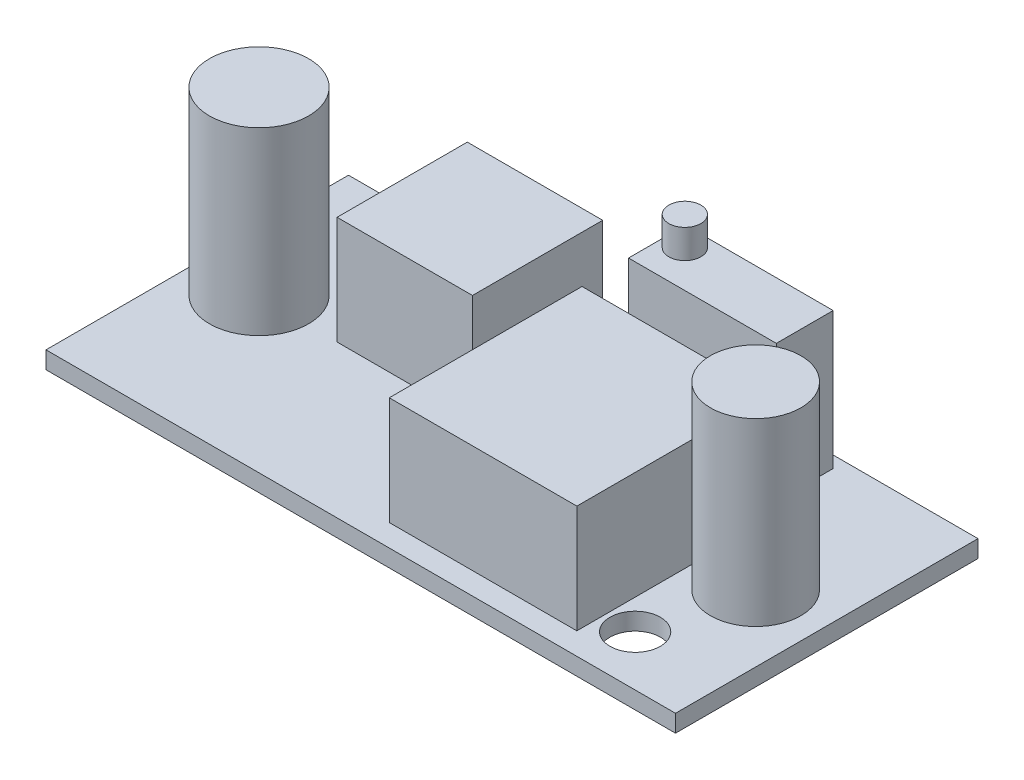
ISO-10303-21;
HEADER;
FILE_DESCRIPTION(('STEP AP214'),'2;1');
FILE_NAME('part.step','',(''),(''),'','','');
FILE_SCHEMA(('AUTOMOTIVE_DESIGN { 1 0 10303 214 1 1 1 1 }'));
ENDSEC;
DATA;
#1=APPLICATION_CONTEXT('core data for automotive mechanical design processes');
#2=APPLICATION_PROTOCOL_DEFINITION('international standard','automotive_design',2000,#1);
#3=PRODUCT_CONTEXT('',#1,'mechanical');
#4=PRODUCT('Part','Part','',(#3));
#5=PRODUCT_RELATED_PRODUCT_CATEGORY('part','',(#4));
#6=PRODUCT_DEFINITION_FORMATION('','',#4);
#7=PRODUCT_DEFINITION_CONTEXT('part definition',#1,'design');
#8=PRODUCT_DEFINITION('design','',#6,#7);
#9=PRODUCT_DEFINITION_SHAPE('','',#8);
#10=(LENGTH_UNIT() NAMED_UNIT(*) SI_UNIT(.MILLI.,.METRE.));
#11=(NAMED_UNIT(*) PLANE_ANGLE_UNIT() SI_UNIT($,.RADIAN.));
#12=(NAMED_UNIT(*) SI_UNIT($,.STERADIAN.) SOLID_ANGLE_UNIT());
#13=UNCERTAINTY_MEASURE_WITH_UNIT(LENGTH_MEASURE(1.E-05),#10,'distance_accuracy_value','');
#14=(GEOMETRIC_REPRESENTATION_CONTEXT(3) GLOBAL_UNCERTAINTY_ASSIGNED_CONTEXT((#13)) GLOBAL_UNIT_ASSIGNED_CONTEXT((#10,
#11,#12)) REPRESENTATION_CONTEXT('',''));
#15=CARTESIAN_POINT('',(0.,0.,0.));
#16=DIRECTION('',(0.,0.,1.));
#17=DIRECTION('',(1.,0.,0.));
#18=AXIS2_PLACEMENT_3D('',#15,#16,#17);
#19=CARTESIAN_POINT('',(0.,1.2,0.));
#20=DIRECTION('',(0.,1.,0.));
#21=DIRECTION('',(0.,0.,1.));
#22=AXIS2_PLACEMENT_3D('',#19,#20,#21);
#23=PLANE('',#22);
#24=CARTESIAN_POINT('',(-32.1196502057613,1.2,-10.7179012345679));
#25=DIRECTION('',(0.,1.,0.));
#26=DIRECTION('',(0.,0.,1.));
#27=AXIS2_PLACEMENT_3D('',#24,#25,#26);
#28=CIRCLE('',#27,1.75);
#29=CARTESIAN_POINT('',(-32.1196502057613,1.2,-8.9679012345679));
#30=VERTEX_POINT('',#29);
#31=EDGE_CURVE('E291',#30,#30,#28,.T.);
#32=ORIENTED_EDGE('',*,*,#31,.F.);
#33=EDGE_LOOP('',(#32));
#34=FACE_BOUND('',#33,.T.);
#35=CARTESIAN_POINT('',(-1.21965020576131,1.2,4.2820987654321));
#36=DIRECTION('',(0.,1.,0.));
#37=DIRECTION('',(0.,0.,1.));
#38=AXIS2_PLACEMENT_3D('',#35,#36,#37);
#39=CIRCLE('',#38,1.75);
#40=CARTESIAN_POINT('',(-1.21965020576131,1.2,6.0320987654321));
#41=VERTEX_POINT('',#40);
#42=EDGE_CURVE('E296',#41,#41,#39,.T.);
#43=ORIENTED_EDGE('',*,*,#42,.F.);
#44=EDGE_LOOP('',(#43));
#45=FACE_BOUND('',#44,.T.);
#46=CARTESIAN_POINT('',(0.431683100456055,1.2,-2.43091340047043));
#47=DIRECTION('',(0.,1.,0.));
#48=DIRECTION('',(0.,0.,1.));
#49=AXIS2_PLACEMENT_3D('',#46,#47,#48);
#50=CIRCLE('',#49,3.13764797817791);
#51=CARTESIAN_POINT('',(0.431683100456055,1.2,0.706734577707483));
#52=VERTEX_POINT('',#51);
#53=EDGE_CURVE('E249',#52,#52,#50,.T.);
#54=ORIENTED_EDGE('',*,*,#53,.F.);
#55=EDGE_LOOP('',(#54));
#56=FACE_BOUND('',#55,.T.);
#57=CARTESIAN_POINT('',(-34.5090857009114,1.2,-2.89726863087882));
#58=DIRECTION('',(0.,1.,0.));
#59=DIRECTION('',(0.,0.,1.));
#60=AXIS2_PLACEMENT_3D('',#57,#58,#59);
#61=CIRCLE('',#60,3.44385400916969);
#62=CARTESIAN_POINT('',(-34.5090857009114,1.2,0.546585378290866));
#63=VERTEX_POINT('',#62);
#64=EDGE_CURVE('E253',#63,#63,#61,.T.);
#65=ORIENTED_EDGE('',*,*,#64,.F.);
#66=EDGE_LOOP('',(#65));
#67=FACE_BOUND('',#66,.T.);
#68=DIRECTION('',(0.,0.,-1.));
#69=VECTOR('',#68,1.);
#70=CARTESIAN_POINT('',(5.08034979423869,1.2,7.7820987654321));
#71=LINE('',#70,#69);
#72=CARTESIAN_POINT('',(5.08034979423869,1.2,7.7820987654321));
#73=VERTEX_POINT('',#72);
#74=CARTESIAN_POINT('',(5.08034979423869,1.2,-13.2179012345679));
#75=VERTEX_POINT('',#74);
#76=EDGE_CURVE('E262',#73,#75,#71,.T.);
#77=ORIENTED_EDGE('',*,*,#76,.T.);
#78=DIRECTION('',(-1.,0.,0.));
#79=VECTOR('',#78,1.);
#80=CARTESIAN_POINT('',(5.08034979423869,1.2,-13.2179012345679));
#81=LINE('',#80,#79);
#82=CARTESIAN_POINT('',(-38.6196502057613,1.2,-13.2179012345679));
#83=VERTEX_POINT('',#82);
#84=EDGE_CURVE('E265',#75,#83,#81,.T.);
#85=ORIENTED_EDGE('',*,*,#84,.T.);
#86=DIRECTION('',(0.,0.,1.));
#87=VECTOR('',#86,1.);
#88=CARTESIAN_POINT('',(-38.6196502057613,1.2,7.7820987654321));
#89=LINE('',#88,#87);
#90=CARTESIAN_POINT('',(-38.6196502057613,1.2,7.7820987654321));
#91=VERTEX_POINT('',#90);
#92=EDGE_CURVE('E268',#83,#91,#89,.T.);
#93=ORIENTED_EDGE('',*,*,#92,.T.);
#94=DIRECTION('',(1.,0.,0.));
#95=VECTOR('',#94,1.);
#96=CARTESIAN_POINT('',(5.08034979423869,1.2,7.7820987654321));
#97=LINE('',#96,#95);
#98=EDGE_CURVE('E270',#91,#73,#97,.T.);
#99=ORIENTED_EDGE('',*,*,#98,.T.);
#100=EDGE_LOOP('',(#77,#85,#93,#99));
#101=FACE_BOUND('',#100,.T.);
#102=DIRECTION('',(1.,0.,0.));
#103=VECTOR('',#102,1.);
#104=CARTESIAN_POINT('',(-16.321231714984,1.2,6.25046858097821));
#105=LINE('',#104,#103);
#106=CARTESIAN_POINT('',(-16.321231714984,1.2,6.25046858097821));
#107=VERTEX_POINT('',#106);
#108=CARTESIAN_POINT('',(-3.29915874281111,1.2,6.25046858097821));
#109=VERTEX_POINT('',#108);
#110=EDGE_CURVE('E234',#107,#109,#105,.T.);
#111=ORIENTED_EDGE('',*,*,#110,.F.);
#112=DIRECTION('',(0.,0.,1.));
#113=VECTOR('',#112,1.);
#114=CARTESIAN_POINT('',(-16.321231714984,1.2,-7.13033918381652));
#115=LINE('',#114,#113);
#116=CARTESIAN_POINT('',(-16.321231714984,1.2,-7.13033918381652));
#117=VERTEX_POINT('',#116);
#118=EDGE_CURVE('E220',#117,#107,#115,.T.);
#119=ORIENTED_EDGE('',*,*,#118,.F.);
#120=DIRECTION('',(-1.,0.,0.));
#121=VECTOR('',#120,1.);
#122=CARTESIAN_POINT('',(-16.321231714984,1.2,-7.13033918381652));
#123=LINE('',#122,#121);
#124=CARTESIAN_POINT('',(-3.29915874281111,1.2,-7.13033918381652));
#125=VERTEX_POINT('',#124);
#126=EDGE_CURVE('E225',#125,#117,#123,.T.);
#127=ORIENTED_EDGE('',*,*,#126,.F.);
#128=DIRECTION('',(0.,0.,-1.));
#129=VECTOR('',#128,1.);
#130=CARTESIAN_POINT('',(-3.29915874281111,1.2,-7.13033918381652));
#131=LINE('',#130,#129);
#132=EDGE_CURVE('E236',#109,#125,#131,.T.);
#133=ORIENTED_EDGE('',*,*,#132,.F.);
#134=EDGE_LOOP('',(#111,#119,#127,#133));
#135=FACE_BOUND('',#134,.T.);
#136=DIRECTION('',(1.,0.,0.));
#137=VECTOR('',#136,1.);
#138=CARTESIAN_POINT('',(-28.984569894535,1.2,-2.78964819309223));
#139=LINE('',#138,#137);
#140=CARTESIAN_POINT('',(-28.984569894535,1.2,-2.78964819309223));
#141=VERTEX_POINT('',#140);
#142=CARTESIAN_POINT('',(-19.5857183278428,1.2,-2.78964819309223));
#143=VERTEX_POINT('',#142);
#144=EDGE_CURVE('E207',#141,#143,#139,.T.);
#145=ORIENTED_EDGE('',*,*,#144,.F.);
#146=DIRECTION('',(0.,0.,1.));
#147=VECTOR('',#146,1.);
#148=CARTESIAN_POINT('',(-28.984569894535,1.2,-11.8297649671627));
#149=LINE('',#148,#147);
#150=CARTESIAN_POINT('',(-28.984569894535,1.2,-11.8297649671627));
#151=VERTEX_POINT('',#150);
#152=EDGE_CURVE('E173',#151,#141,#149,.T.);
#153=ORIENTED_EDGE('',*,*,#152,.F.);
#154=DIRECTION('',(-1.,0.,0.));
#155=VECTOR('',#154,1.);
#156=CARTESIAN_POINT('',(-28.984569894535,1.2,-11.8297649671627));
#157=LINE('',#156,#155);
#158=CARTESIAN_POINT('',(-19.5857183278428,1.2,-11.8297649671627));
#159=VERTEX_POINT('',#158);
#160=EDGE_CURVE('E198',#159,#151,#157,.T.);
#161=ORIENTED_EDGE('',*,*,#160,.F.);
#162=DIRECTION('',(0.,0.,-1.));
#163=VECTOR('',#162,1.);
#164=CARTESIAN_POINT('',(-19.5857183278428,1.2,-11.8297649671627));
#165=LINE('',#164,#163);
#166=EDGE_CURVE('E209',#143,#159,#165,.T.);
#167=ORIENTED_EDGE('',*,*,#166,.F.);
#168=EDGE_LOOP('',(#145,#153,#161,#167));
#169=FACE_BOUND('',#168,.T.);
#170=DIRECTION('',(0.,0.,1.));
#171=VECTOR('',#170,1.);
#172=CARTESIAN_POINT('',(-4.16012224510353,1.2,-12.4037406353576));
#173=LINE('',#172,#171);
#174=CARTESIAN_POINT('',(-4.16012224510353,1.2,-12.4037406353576));
#175=VERTEX_POINT('',#174);
#176=CARTESIAN_POINT('',(-4.16012224510353,1.2,-8.45765791651734));
#177=VERTEX_POINT('',#176);
#178=EDGE_CURVE('E185',#175,#177,#173,.T.);
#179=ORIENTED_EDGE('',*,*,#178,.T.);
#180=DIRECTION('',(1.,0.,0.));
#181=VECTOR('',#180,1.);
#182=CARTESIAN_POINT('',(-14.4199373140882,1.2,-8.45765791651734));
#183=LINE('',#182,#181);
#184=CARTESIAN_POINT('',(-14.4199373140882,1.2,-8.45765791651734));
#185=VERTEX_POINT('',#184);
#186=EDGE_CURVE('E169',#185,#177,#183,.T.);
#187=ORIENTED_EDGE('',*,*,#186,.F.);
#188=DIRECTION('',(0.,0.,1.));
#189=VECTOR('',#188,1.);
#190=CARTESIAN_POINT('',(-14.4199373140882,1.2,-12.4037406353576));
#191=LINE('',#190,#189);
#192=CARTESIAN_POINT('',(-14.4199373140882,1.2,-12.4037406353576));
#193=VERTEX_POINT('',#192);
#194=EDGE_CURVE('E163',#193,#185,#191,.T.);
#195=ORIENTED_EDGE('',*,*,#194,.F.);
#196=DIRECTION('',(1.,0.,0.));
#197=VECTOR('',#196,1.);
#198=CARTESIAN_POINT('',(-14.4199373140882,1.2,-12.4037406353576));
#199=LINE('',#198,#197);
#200=EDGE_CURVE('E52',#193,#175,#199,.T.);
#201=ORIENTED_EDGE('',*,*,#200,.T.);
#202=EDGE_LOOP('',(#179,#187,#195,#201));
#203=FACE_BOUND('',#202,.T.);
#204=ADVANCED_FACE('F35',(#34,#45,#56,#67,#101,#135,#169,#203),#23,.T.);
#205=CARTESIAN_POINT('',(5.08034979423869,1.2,7.7820987654321));
#206=DIRECTION('',(-1.,0.,0.));
#207=DIRECTION('',(0.,0.,1.));
#208=AXIS2_PLACEMENT_3D('',#205,#206,#207);
#209=PLANE('',#208);
#210=DIRECTION('',(0.,0.,-1.));
#211=VECTOR('',#210,1.);
#212=CARTESIAN_POINT('',(5.08034979423869,0.,7.7820987654321));
#213=LINE('',#212,#211);
#214=CARTESIAN_POINT('',(5.08034979423869,0.,7.7820987654321));
#215=VERTEX_POINT('',#214);
#216=CARTESIAN_POINT('',(5.08034979423869,0.,-13.2179012345679));
#217=VERTEX_POINT('',#216);
#218=EDGE_CURVE('E259',#215,#217,#213,.T.);
#219=ORIENTED_EDGE('',*,*,#218,.T.);
#220=DIRECTION('',(0.,-1.,0.));
#221=VECTOR('',#220,1.);
#222=CARTESIAN_POINT('',(5.08034979423869,1.2,-13.2179012345679));
#223=LINE('',#222,#221);
#224=EDGE_CURVE('E44',#75,#217,#223,.T.);
#225=ORIENTED_EDGE('',*,*,#224,.F.);
#226=ORIENTED_EDGE('',*,*,#76,.F.);
#227=DIRECTION('',(0.,-1.,0.));
#228=VECTOR('',#227,1.);
#229=CARTESIAN_POINT('',(5.08034979423869,1.2,7.7820987654321));
#230=LINE('',#229,#228);
#231=EDGE_CURVE('E272',#73,#215,#230,.T.);
#232=ORIENTED_EDGE('',*,*,#231,.T.);
#233=EDGE_LOOP('',(#219,#225,#226,#232));
#234=FACE_BOUND('',#233,.T.);
#235=ADVANCED_FACE('F37',(#234),#209,.F.);
#236=CARTESIAN_POINT('',(5.08034979423869,1.2,-13.2179012345679));
#237=DIRECTION('',(0.,0.,1.));
#238=DIRECTION('',(1.,0.,0.));
#239=AXIS2_PLACEMENT_3D('',#236,#237,#238);
#240=PLANE('',#239);
#241=DIRECTION('',(-1.,0.,0.));
#242=VECTOR('',#241,1.);
#243=CARTESIAN_POINT('',(5.08034979423869,0.,-13.2179012345679));
#244=LINE('',#243,#242);
#245=CARTESIAN_POINT('',(-38.6196502057613,0.,-13.2179012345679));
#246=VERTEX_POINT('',#245);
#247=EDGE_CURVE('E275',#217,#246,#244,.T.);
#248=ORIENTED_EDGE('',*,*,#247,.T.);
#249=DIRECTION('',(0.,-1.,0.));
#250=VECTOR('',#249,1.);
#251=CARTESIAN_POINT('',(-38.6196502057613,1.2,-13.2179012345679));
#252=LINE('',#251,#250);
#253=EDGE_CURVE('E285',#83,#246,#252,.T.);
#254=ORIENTED_EDGE('',*,*,#253,.F.);
#255=ORIENTED_EDGE('',*,*,#84,.F.);
#256=ORIENTED_EDGE('',*,*,#224,.T.);
#257=EDGE_LOOP('',(#248,#254,#255,#256));
#258=FACE_BOUND('',#257,.T.);
#259=ADVANCED_FACE('F328',(#258),#240,.F.);
#260=CARTESIAN_POINT('',(-38.6196502057613,1.2,7.7820987654321));
#261=DIRECTION('',(1.,0.,0.));
#262=DIRECTION('',(0.,0.,-1.));
#263=AXIS2_PLACEMENT_3D('',#260,#261,#262);
#264=PLANE('',#263);
#265=DIRECTION('',(0.,0.,1.));
#266=VECTOR('',#265,1.);
#267=CARTESIAN_POINT('',(-38.6196502057613,0.,7.7820987654321));
#268=LINE('',#267,#266);
#269=CARTESIAN_POINT('',(-38.6196502057613,0.,7.7820987654321));
#270=VERTEX_POINT('',#269);
#271=EDGE_CURVE('E277',#246,#270,#268,.T.);
#272=ORIENTED_EDGE('',*,*,#271,.T.);
#273=DIRECTION('',(0.,-1.,0.));
#274=VECTOR('',#273,1.);
#275=CARTESIAN_POINT('',(-38.6196502057613,1.2,7.7820987654321));
#276=LINE('',#275,#274);
#277=EDGE_CURVE('E282',#91,#270,#276,.T.);
#278=ORIENTED_EDGE('',*,*,#277,.F.);
#279=ORIENTED_EDGE('',*,*,#92,.F.);
#280=ORIENTED_EDGE('',*,*,#253,.T.);
#281=EDGE_LOOP('',(#272,#278,#279,#280));
#282=FACE_BOUND('',#281,.T.);
#283=ADVANCED_FACE('F342',(#282),#264,.F.);
#284=CARTESIAN_POINT('',(5.08034979423869,1.2,7.7820987654321));
#285=DIRECTION('',(0.,0.,-1.));
#286=DIRECTION('',(-1.,0.,0.));
#287=AXIS2_PLACEMENT_3D('',#284,#285,#286);
#288=PLANE('',#287);
#289=DIRECTION('',(1.,0.,0.));
#290=VECTOR('',#289,1.);
#291=CARTESIAN_POINT('',(5.08034979423869,0.,7.7820987654321));
#292=LINE('',#291,#290);
#293=EDGE_CURVE('E266',#270,#215,#292,.T.);
#294=ORIENTED_EDGE('',*,*,#293,.T.);
#295=ORIENTED_EDGE('',*,*,#231,.F.);
#296=ORIENTED_EDGE('',*,*,#98,.F.);
#297=ORIENTED_EDGE('',*,*,#277,.T.);
#298=EDGE_LOOP('',(#294,#295,#296,#297));
#299=FACE_BOUND('',#298,.T.);
#300=ADVANCED_FACE('F338',(#299),#288,.F.);
#301=CARTESIAN_POINT('',(0.,0.,0.));
#302=DIRECTION('',(0.,1.,0.));
#303=DIRECTION('',(0.,0.,1.));
#304=AXIS2_PLACEMENT_3D('',#301,#302,#303);
#305=PLANE('',#304);
#306=CARTESIAN_POINT('',(-32.1196502057613,0.,-10.7179012345679));
#307=DIRECTION('',(0.,1.,0.));
#308=DIRECTION('',(0.,0.,1.));
#309=AXIS2_PLACEMENT_3D('',#306,#307,#308);
#310=CIRCLE('',#309,1.75);
#311=CARTESIAN_POINT('',(-32.1196502057613,0.,-8.9679012345679));
#312=VERTEX_POINT('',#311);
#313=EDGE_CURVE('E39',#312,#312,#310,.T.);
#314=ORIENTED_EDGE('',*,*,#313,.T.);
#315=EDGE_LOOP('',(#314));
#316=FACE_BOUND('',#315,.T.);
#317=CARTESIAN_POINT('',(-1.21965020576131,0.,4.2820987654321));
#318=DIRECTION('',(0.,1.,0.));
#319=DIRECTION('',(0.,0.,1.));
#320=AXIS2_PLACEMENT_3D('',#317,#318,#319);
#321=CIRCLE('',#320,1.75);
#322=CARTESIAN_POINT('',(-1.21965020576131,0.,6.0320987654321));
#323=VERTEX_POINT('',#322);
#324=EDGE_CURVE('E289',#323,#323,#321,.T.);
#325=ORIENTED_EDGE('',*,*,#324,.T.);
#326=EDGE_LOOP('',(#325));
#327=FACE_BOUND('',#326,.T.);
#328=ORIENTED_EDGE('',*,*,#218,.F.);
#329=ORIENTED_EDGE('',*,*,#293,.F.);
#330=ORIENTED_EDGE('',*,*,#271,.F.);
#331=ORIENTED_EDGE('',*,*,#247,.F.);
#332=EDGE_LOOP('',(#328,#329,#330,#331));
#333=FACE_BOUND('',#332,.T.);
#334=ADVANCED_FACE('F335',(#316,#327,#333),#305,.F.);
#335=CARTESIAN_POINT('',(-34.5090857009114,13.7,-2.89726863087882));
#336=DIRECTION('',(0.,-1.,0.));
#337=DIRECTION('',(0.,0.,-1.));
#338=AXIS2_PLACEMENT_3D('',#335,#336,#337);
#339=CYLINDRICAL_SURFACE('',#338,3.44385400916969);
#340=CARTESIAN_POINT('',(-34.5090857009114,13.7,-2.89726863087882));
#341=DIRECTION('',(0.,1.,0.));
#342=DIRECTION('',(0.,0.,1.));
#343=AXIS2_PLACEMENT_3D('',#340,#341,#342);
#344=CIRCLE('',#343,3.44385400916969);
#345=CARTESIAN_POINT('',(-34.5090857009114,13.7,0.546585378290866));
#346=VERTEX_POINT('',#345);
#347=EDGE_CURVE('E256',#346,#346,#344,.T.);
#348=ORIENTED_EDGE('',*,*,#347,.F.);
#349=EDGE_LOOP('',(#348));
#350=FACE_BOUND('',#349,.T.);
#351=ORIENTED_EDGE('',*,*,#64,.T.);
#352=EDGE_LOOP('',(#351));
#353=FACE_BOUND('',#352,.T.);
#354=ADVANCED_FACE('F333',(#350,#353),#339,.T.);
#355=CARTESIAN_POINT('',(-34.5090857009114,13.7,-2.89726863087882));
#356=DIRECTION('',(0.,1.,0.));
#357=DIRECTION('',(0.,0.,1.));
#358=AXIS2_PLACEMENT_3D('',#355,#356,#357);
#359=PLANE('',#358);
#360=ORIENTED_EDGE('',*,*,#347,.T.);
#361=EDGE_LOOP('',(#360));
#362=FACE_BOUND('',#361,.T.);
#363=ADVANCED_FACE('F426',(#362),#359,.T.);
#364=CARTESIAN_POINT('',(0.431683100456055,13.7,-2.43091340047043));
#365=DIRECTION('',(0.,-1.,0.));
#366=DIRECTION('',(0.,0.,-1.));
#367=AXIS2_PLACEMENT_3D('',#364,#365,#366);
#368=CYLINDRICAL_SURFACE('',#367,3.13764797817791);
#369=CARTESIAN_POINT('',(0.431683100456055,13.7,-2.43091340047043));
#370=DIRECTION('',(0.,1.,0.));
#371=DIRECTION('',(0.,0.,1.));
#372=AXIS2_PLACEMENT_3D('',#369,#370,#371);
#373=CIRCLE('',#372,3.13764797817791);
#374=CARTESIAN_POINT('',(0.431683100456055,13.7,0.706734577707483));
#375=VERTEX_POINT('',#374);
#376=EDGE_CURVE('E250',#375,#375,#373,.T.);
#377=ORIENTED_EDGE('',*,*,#376,.F.);
#378=EDGE_LOOP('',(#377));
#379=FACE_BOUND('',#378,.T.);
#380=ORIENTED_EDGE('',*,*,#53,.T.);
#381=EDGE_LOOP('',(#380));
#382=FACE_BOUND('',#381,.T.);
#383=ADVANCED_FACE('F423',(#379,#382),#368,.T.);
#384=CARTESIAN_POINT('',(0.431683100456055,13.7,-2.43091340047043));
#385=DIRECTION('',(0.,1.,0.));
#386=DIRECTION('',(0.,0.,1.));
#387=AXIS2_PLACEMENT_3D('',#384,#385,#386);
#388=PLANE('',#387);
#389=ORIENTED_EDGE('',*,*,#376,.T.);
#390=EDGE_LOOP('',(#389));
#391=FACE_BOUND('',#390,.T.);
#392=ADVANCED_FACE('F419',(#391),#388,.T.);
#393=CARTESIAN_POINT('',(-16.321231714984,8.7,-7.13033918381652));
#394=DIRECTION('',(1.,0.,0.));
#395=DIRECTION('',(0.,0.,-1.));
#396=AXIS2_PLACEMENT_3D('',#393,#394,#395);
#397=PLANE('',#396);
#398=ORIENTED_EDGE('',*,*,#118,.T.);
#399=DIRECTION('',(0.,-1.,0.));
#400=VECTOR('',#399,1.);
#401=CARTESIAN_POINT('',(-16.321231714984,8.7,6.25046858097821));
#402=LINE('',#401,#400);
#403=CARTESIAN_POINT('',(-16.321231714984,8.7,6.25046858097821));
#404=VERTEX_POINT('',#403);
#405=EDGE_CURVE('E247',#404,#107,#402,.T.);
#406=ORIENTED_EDGE('',*,*,#405,.F.);
#407=DIRECTION('',(0.,0.,1.));
#408=VECTOR('',#407,1.);
#409=CARTESIAN_POINT('',(-16.321231714984,8.7,-7.13033918381652));
#410=LINE('',#409,#408);
#411=CARTESIAN_POINT('',(-16.321231714984,8.7,-7.13033918381652));
#412=VERTEX_POINT('',#411);
#413=EDGE_CURVE('E221',#412,#404,#410,.T.);
#414=ORIENTED_EDGE('',*,*,#413,.F.);
#415=DIRECTION('',(0.,-1.,0.));
#416=VECTOR('',#415,1.);
#417=CARTESIAN_POINT('',(-16.321231714984,8.7,-7.13033918381652));
#418=LINE('',#417,#416);
#419=EDGE_CURVE('E231',#412,#117,#418,.T.);
#420=ORIENTED_EDGE('',*,*,#419,.T.);
#421=EDGE_LOOP('',(#398,#406,#414,#420));
#422=FACE_BOUND('',#421,.T.);
#423=ADVANCED_FACE('F415',(#422),#397,.F.);
#424=CARTESIAN_POINT('',(-16.321231714984,8.7,6.25046858097821));
#425=DIRECTION('',(0.,0.,-1.));
#426=DIRECTION('',(-1.,0.,0.));
#427=AXIS2_PLACEMENT_3D('',#424,#425,#426);
#428=PLANE('',#427);
#429=ORIENTED_EDGE('',*,*,#110,.T.);
#430=DIRECTION('',(0.,-1.,0.));
#431=VECTOR('',#430,1.);
#432=CARTESIAN_POINT('',(-3.29915874281111,8.7,6.25046858097821));
#433=LINE('',#432,#431);
#434=CARTESIAN_POINT('',(-3.29915874281111,8.7,6.25046858097821));
#435=VERTEX_POINT('',#434);
#436=EDGE_CURVE('E244',#435,#109,#433,.T.);
#437=ORIENTED_EDGE('',*,*,#436,.F.);
#438=DIRECTION('',(1.,0.,0.));
#439=VECTOR('',#438,1.);
#440=CARTESIAN_POINT('',(-16.321231714984,8.7,6.25046858097821));
#441=LINE('',#440,#439);
#442=EDGE_CURVE('E224',#404,#435,#441,.T.);
#443=ORIENTED_EDGE('',*,*,#442,.F.);
#444=ORIENTED_EDGE('',*,*,#405,.T.);
#445=EDGE_LOOP('',(#429,#437,#443,#444));
#446=FACE_BOUND('',#445,.T.);
#447=ADVANCED_FACE('F411',(#446),#428,.F.);
#448=CARTESIAN_POINT('',(-3.29915874281111,8.7,-7.13033918381652));
#449=DIRECTION('',(-1.,0.,0.));
#450=DIRECTION('',(0.,0.,1.));
#451=AXIS2_PLACEMENT_3D('',#448,#449,#450);
#452=PLANE('',#451);
#453=ORIENTED_EDGE('',*,*,#132,.T.);
#454=DIRECTION('',(0.,-1.,0.));
#455=VECTOR('',#454,1.);
#456=CARTESIAN_POINT('',(-3.29915874281111,8.7,-7.13033918381652));
#457=LINE('',#456,#455);
#458=CARTESIAN_POINT('',(-3.29915874281111,8.7,-7.13033918381652));
#459=VERTEX_POINT('',#458);
#460=EDGE_CURVE('E242',#459,#125,#457,.T.);
#461=ORIENTED_EDGE('',*,*,#460,.F.);
#462=DIRECTION('',(0.,0.,-1.));
#463=VECTOR('',#462,1.);
#464=CARTESIAN_POINT('',(-3.29915874281111,8.7,-7.13033918381652));
#465=LINE('',#464,#463);
#466=EDGE_CURVE('E227',#435,#459,#465,.T.);
#467=ORIENTED_EDGE('',*,*,#466,.F.);
#468=ORIENTED_EDGE('',*,*,#436,.T.);
#469=EDGE_LOOP('',(#453,#461,#467,#468));
#470=FACE_BOUND('',#469,.T.);
#471=ADVANCED_FACE('F407',(#470),#452,.F.);
#472=CARTESIAN_POINT('',(-16.321231714984,8.7,-7.13033918381652));
#473=DIRECTION('',(0.,0.,1.));
#474=DIRECTION('',(1.,0.,0.));
#475=AXIS2_PLACEMENT_3D('',#472,#473,#474);
#476=PLANE('',#475);
#477=ORIENTED_EDGE('',*,*,#126,.T.);
#478=ORIENTED_EDGE('',*,*,#419,.F.);
#479=DIRECTION('',(-1.,0.,0.));
#480=VECTOR('',#479,1.);
#481=CARTESIAN_POINT('',(-16.321231714984,8.7,-7.13033918381652));
#482=LINE('',#481,#480);
#483=EDGE_CURVE('E229',#459,#412,#482,.T.);
#484=ORIENTED_EDGE('',*,*,#483,.F.);
#485=ORIENTED_EDGE('',*,*,#460,.T.);
#486=EDGE_LOOP('',(#477,#478,#484,#485));
#487=FACE_BOUND('',#486,.T.);
#488=ADVANCED_FACE('F403',(#487),#476,.F.);
#489=CARTESIAN_POINT('',(0.,8.7,0.));
#490=DIRECTION('',(0.,1.,0.));
#491=DIRECTION('',(0.,0.,1.));
#492=AXIS2_PLACEMENT_3D('',#489,#490,#491);
#493=PLANE('',#492);
#494=ORIENTED_EDGE('',*,*,#413,.T.);
#495=ORIENTED_EDGE('',*,*,#442,.T.);
#496=ORIENTED_EDGE('',*,*,#466,.T.);
#497=ORIENTED_EDGE('',*,*,#483,.T.);
#498=EDGE_LOOP('',(#494,#495,#496,#497));
#499=FACE_BOUND('',#498,.T.);
#500=ADVANCED_FACE('F399',(#499),#493,.T.);
#501=CARTESIAN_POINT('',(-28.984569894535,8.7,-11.8297649671627));
#502=DIRECTION('',(1.,0.,0.));
#503=DIRECTION('',(0.,0.,-1.));
#504=AXIS2_PLACEMENT_3D('',#501,#502,#503);
#505=PLANE('',#504);
#506=ORIENTED_EDGE('',*,*,#152,.T.);
#507=DIRECTION('',(0.,-1.,0.));
#508=VECTOR('',#507,1.);
#509=CARTESIAN_POINT('',(-28.984569894535,8.7,-2.78964819309223));
#510=LINE('',#509,#508);
#511=CARTESIAN_POINT('',(-28.984569894535,8.7,-2.78964819309223));
#512=VERTEX_POINT('',#511);
#513=EDGE_CURVE('E218',#512,#141,#510,.T.);
#514=ORIENTED_EDGE('',*,*,#513,.F.);
#515=DIRECTION('',(0.,0.,1.));
#516=VECTOR('',#515,1.);
#517=CARTESIAN_POINT('',(-28.984569894535,8.7,-11.8297649671627));
#518=LINE('',#517,#516);
#519=CARTESIAN_POINT('',(-28.984569894535,8.7,-11.8297649671627));
#520=VERTEX_POINT('',#519);
#521=EDGE_CURVE('E194',#520,#512,#518,.T.);
#522=ORIENTED_EDGE('',*,*,#521,.F.);
#523=DIRECTION('',(0.,-1.,0.));
#524=VECTOR('',#523,1.);
#525=CARTESIAN_POINT('',(-28.984569894535,8.7,-11.8297649671627));
#526=LINE('',#525,#524);
#527=EDGE_CURVE('E204',#520,#151,#526,.T.);
#528=ORIENTED_EDGE('',*,*,#527,.T.);
#529=EDGE_LOOP('',(#506,#514,#522,#528));
#530=FACE_BOUND('',#529,.T.);
#531=ADVANCED_FACE('F395',(#530),#505,.F.);
#532=CARTESIAN_POINT('',(-28.984569894535,8.7,-2.78964819309223));
#533=DIRECTION('',(0.,0.,-1.));
#534=DIRECTION('',(-1.,0.,0.));
#535=AXIS2_PLACEMENT_3D('',#532,#533,#534);
#536=PLANE('',#535);
#537=ORIENTED_EDGE('',*,*,#144,.T.);
#538=DIRECTION('',(0.,-1.,0.));
#539=VECTOR('',#538,1.);
#540=CARTESIAN_POINT('',(-19.5857183278428,8.7,-2.78964819309223));
#541=LINE('',#540,#539);
#542=CARTESIAN_POINT('',(-19.5857183278428,8.7,-2.78964819309223));
#543=VERTEX_POINT('',#542);
#544=EDGE_CURVE('E215',#543,#143,#541,.T.);
#545=ORIENTED_EDGE('',*,*,#544,.F.);
#546=DIRECTION('',(1.,0.,0.));
#547=VECTOR('',#546,1.);
#548=CARTESIAN_POINT('',(-28.984569894535,8.7,-2.78964819309223));
#549=LINE('',#548,#547);
#550=EDGE_CURVE('E197',#512,#543,#549,.T.);
#551=ORIENTED_EDGE('',*,*,#550,.F.);
#552=ORIENTED_EDGE('',*,*,#513,.T.);
#553=EDGE_LOOP('',(#537,#545,#551,#552));
#554=FACE_BOUND('',#553,.T.);
#555=ADVANCED_FACE('F391',(#554),#536,.F.);
#556=CARTESIAN_POINT('',(-19.5857183278428,8.7,-11.8297649671627));
#557=DIRECTION('',(-1.,0.,0.));
#558=DIRECTION('',(0.,0.,1.));
#559=AXIS2_PLACEMENT_3D('',#556,#557,#558);
#560=PLANE('',#559);
#561=ORIENTED_EDGE('',*,*,#166,.T.);
#562=DIRECTION('',(0.,-1.,0.));
#563=VECTOR('',#562,1.);
#564=CARTESIAN_POINT('',(-19.5857183278428,8.7,-11.8297649671627));
#565=LINE('',#564,#563);
#566=CARTESIAN_POINT('',(-19.5857183278428,8.7,-11.8297649671627));
#567=VERTEX_POINT('',#566);
#568=EDGE_CURVE('E60',#567,#159,#565,.T.);
#569=ORIENTED_EDGE('',*,*,#568,.F.);
#570=DIRECTION('',(0.,0.,-1.));
#571=VECTOR('',#570,1.);
#572=CARTESIAN_POINT('',(-19.5857183278428,8.7,-11.8297649671627));
#573=LINE('',#572,#571);
#574=EDGE_CURVE('E200',#543,#567,#573,.T.);
#575=ORIENTED_EDGE('',*,*,#574,.F.);
#576=ORIENTED_EDGE('',*,*,#544,.T.);
#577=EDGE_LOOP('',(#561,#569,#575,#576));
#578=FACE_BOUND('',#577,.T.);
#579=ADVANCED_FACE('F388',(#578),#560,.F.);
#580=CARTESIAN_POINT('',(-28.984569894535,8.7,-11.8297649671627));
#581=DIRECTION('',(0.,0.,1.));
#582=DIRECTION('',(1.,0.,0.));
#583=AXIS2_PLACEMENT_3D('',#580,#581,#582);
#584=PLANE('',#583);
#585=ORIENTED_EDGE('',*,*,#160,.T.);
#586=ORIENTED_EDGE('',*,*,#527,.F.);
#587=DIRECTION('',(-1.,0.,0.));
#588=VECTOR('',#587,1.);
#589=CARTESIAN_POINT('',(-28.984569894535,8.7,-11.8297649671627));
#590=LINE('',#589,#588);
#591=EDGE_CURVE('E202',#567,#520,#590,.T.);
#592=ORIENTED_EDGE('',*,*,#591,.F.);
#593=ORIENTED_EDGE('',*,*,#568,.T.);
#594=EDGE_LOOP('',(#585,#586,#592,#593));
#595=FACE_BOUND('',#594,.T.);
#596=ADVANCED_FACE('F384',(#595),#584,.F.);
#597=CARTESIAN_POINT('',(0.,8.7,0.));
#598=DIRECTION('',(0.,1.,0.));
#599=DIRECTION('',(0.,0.,1.));
#600=AXIS2_PLACEMENT_3D('',#597,#598,#599);
#601=PLANE('',#600);
#602=ORIENTED_EDGE('',*,*,#521,.T.);
#603=ORIENTED_EDGE('',*,*,#550,.T.);
#604=ORIENTED_EDGE('',*,*,#574,.T.);
#605=ORIENTED_EDGE('',*,*,#591,.T.);
#606=EDGE_LOOP('',(#602,#603,#604,#605));
#607=FACE_BOUND('',#606,.T.);
#608=ADVANCED_FACE('F381',(#607),#601,.T.);
#609=CARTESIAN_POINT('',(-14.4199373140882,10.7,-8.45765791651734));
#610=DIRECTION('',(0.,0.,-1.));
#611=DIRECTION('',(-1.,0.,0.));
#612=AXIS2_PLACEMENT_3D('',#609,#610,#611);
#613=PLANE('',#612);
#614=ORIENTED_EDGE('',*,*,#186,.T.);
#615=DIRECTION('',(0.,-1.,0.));
#616=VECTOR('',#615,1.);
#617=CARTESIAN_POINT('',(-4.16012224510353,10.7,-8.45765791651734));
#618=LINE('',#617,#616);
#619=CARTESIAN_POINT('',(-4.16012224510353,10.7,-8.45765791651734));
#620=VERTEX_POINT('',#619);
#621=EDGE_CURVE('E166',#620,#177,#618,.T.);
#622=ORIENTED_EDGE('',*,*,#621,.F.);
#623=DIRECTION('',(1.,0.,0.));
#624=VECTOR('',#623,1.);
#625=CARTESIAN_POINT('',(-14.4199373140882,10.7,-8.45765791651734));
#626=LINE('',#625,#624);
#627=CARTESIAN_POINT('',(-14.4199373140882,10.7,-8.45765791651734));
#628=VERTEX_POINT('',#627);
#629=EDGE_CURVE('E151',#628,#620,#626,.T.);
#630=ORIENTED_EDGE('',*,*,#629,.F.);
#631=DIRECTION('',(0.,-1.,0.));
#632=VECTOR('',#631,1.);
#633=CARTESIAN_POINT('',(-14.4199373140882,10.7,-8.45765791651734));
#634=LINE('',#633,#632);
#635=EDGE_CURVE('E183',#628,#185,#634,.T.);
#636=ORIENTED_EDGE('',*,*,#635,.T.);
#637=EDGE_LOOP('',(#614,#622,#630,#636));
#638=FACE_BOUND('',#637,.T.);
#639=ADVANCED_FACE('F167',(#638),#613,.F.);
#640=CARTESIAN_POINT('',(-4.16012224510353,10.7,-12.4037406353576));
#641=DIRECTION('',(1.,0.,0.));
#642=DIRECTION('',(0.,0.,-1.));
#643=AXIS2_PLACEMENT_3D('',#640,#641,#642);
#644=PLANE('',#643);
#645=ORIENTED_EDGE('',*,*,#178,.F.);
#646=DIRECTION('',(0.,-1.,0.));
#647=VECTOR('',#646,1.);
#648=CARTESIAN_POINT('',(-4.16012224510353,10.7,-12.4037406353576));
#649=LINE('',#648,#647);
#650=CARTESIAN_POINT('',(-4.16012224510353,10.7,-12.4037406353576));
#651=VERTEX_POINT('',#650);
#652=EDGE_CURVE('E174',#651,#175,#649,.T.);
#653=ORIENTED_EDGE('',*,*,#652,.F.);
#654=DIRECTION('',(0.,0.,1.));
#655=VECTOR('',#654,1.);
#656=CARTESIAN_POINT('',(-4.16012224510353,10.7,-12.4037406353576));
#657=LINE('',#656,#655);
#658=EDGE_CURVE('E156',#651,#620,#657,.T.);
#659=ORIENTED_EDGE('',*,*,#658,.T.);
#660=ORIENTED_EDGE('',*,*,#621,.T.);
#661=EDGE_LOOP('',(#645,#653,#659,#660));
#662=FACE_BOUND('',#661,.T.);
#663=ADVANCED_FACE('F176',(#662),#644,.T.);
#664=CARTESIAN_POINT('',(-14.4199373140882,10.7,-12.4037406353576));
#665=DIRECTION('',(0.,0.,-1.));
#666=DIRECTION('',(-1.,0.,0.));
#667=AXIS2_PLACEMENT_3D('',#664,#665,#666);
#668=PLANE('',#667);
#669=ORIENTED_EDGE('',*,*,#200,.F.);
#670=DIRECTION('',(0.,-1.,0.));
#671=VECTOR('',#670,1.);
#672=CARTESIAN_POINT('',(-14.4199373140882,10.7,-12.4037406353576));
#673=LINE('',#672,#671);
#674=CARTESIAN_POINT('',(-14.4199373140882,10.7,-12.4037406353576));
#675=VERTEX_POINT('',#674);
#676=EDGE_CURVE('E191',#675,#193,#673,.T.);
#677=ORIENTED_EDGE('',*,*,#676,.F.);
#678=DIRECTION('',(1.,0.,0.));
#679=VECTOR('',#678,1.);
#680=CARTESIAN_POINT('',(-14.4199373140882,10.7,-12.4037406353576));
#681=LINE('',#680,#679);
#682=EDGE_CURVE('E177',#675,#651,#681,.T.);
#683=ORIENTED_EDGE('',*,*,#682,.T.);
#684=ORIENTED_EDGE('',*,*,#652,.T.);
#685=EDGE_LOOP('',(#669,#677,#683,#684));
#686=FACE_BOUND('',#685,.T.);
#687=ADVANCED_FACE('F319',(#686),#668,.T.);
#688=CARTESIAN_POINT('',(-14.4199373140882,10.7,-12.4037406353576));
#689=DIRECTION('',(1.,0.,0.));
#690=DIRECTION('',(0.,0.,-1.));
#691=AXIS2_PLACEMENT_3D('',#688,#689,#690);
#692=PLANE('',#691);
#693=ORIENTED_EDGE('',*,*,#194,.T.);
#694=ORIENTED_EDGE('',*,*,#635,.F.);
#695=DIRECTION('',(0.,0.,1.));
#696=VECTOR('',#695,1.);
#697=CARTESIAN_POINT('',(-14.4199373140882,10.7,-12.4037406353576));
#698=LINE('',#697,#696);
#699=EDGE_CURVE('E159',#675,#628,#698,.T.);
#700=ORIENTED_EDGE('',*,*,#699,.F.);
#701=ORIENTED_EDGE('',*,*,#676,.T.);
#702=EDGE_LOOP('',(#693,#694,#700,#701));
#703=FACE_BOUND('',#702,.T.);
#704=ADVANCED_FACE('F314',(#703),#692,.F.);
#705=CARTESIAN_POINT('',(0.,10.7,0.));
#706=DIRECTION('',(0.,-1.,0.));
#707=DIRECTION('',(0.,0.,-1.));
#708=AXIS2_PLACEMENT_3D('',#705,#706,#707);
#709=PLANE('',#708);
#710=CARTESIAN_POINT('',(-13.0926185813874,10.7,-11.0405484233947));
#711=DIRECTION('',(0.,-1.,0.));
#712=DIRECTION('',(0.,0.,-1.));
#713=AXIS2_PLACEMENT_3D('',#710,#711,#712);
#714=CIRCLE('',#713,1.11207785712771);
#715=CARTESIAN_POINT('',(-13.0926185813874,10.7,-12.1526262805224));
#716=VERTEX_POINT('',#715);
#717=EDGE_CURVE('E11',#716,#716,#714,.F.);
#718=ORIENTED_EDGE('',*,*,#717,.F.);
#719=EDGE_LOOP('',(#718));
#720=FACE_BOUND('',#719,.T.);
#721=ORIENTED_EDGE('',*,*,#629,.T.);
#722=ORIENTED_EDGE('',*,*,#658,.F.);
#723=ORIENTED_EDGE('',*,*,#682,.F.);
#724=ORIENTED_EDGE('',*,*,#699,.T.);
#725=EDGE_LOOP('',(#721,#722,#723,#724));
#726=FACE_BOUND('',#725,.T.);
#727=ADVANCED_FACE('F153',(#720,#726),#709,.F.);
#728=CARTESIAN_POINT('',(-13.0926185813874,12.7,-11.0405484233947));
#729=DIRECTION('',(0.,-1.,0.));
#730=DIRECTION('',(0.,0.,-1.));
#731=AXIS2_PLACEMENT_3D('',#728,#729,#730);
#732=CYLINDRICAL_SURFACE('',#731,1.11207785712771);
#733=CARTESIAN_POINT('',(-13.0926185813874,12.7,-11.0405484233947));
#734=DIRECTION('',(0.,1.,0.));
#735=DIRECTION('',(0.,0.,1.));
#736=AXIS2_PLACEMENT_3D('',#733,#734,#735);
#737=CIRCLE('',#736,1.11207785712771);
#738=CARTESIAN_POINT('',(-13.0926185813874,12.7,-9.92847056626696));
#739=VERTEX_POINT('',#738);
#740=EDGE_CURVE('E186',#739,#739,#737,.T.);
#741=ORIENTED_EDGE('',*,*,#740,.F.);
#742=EDGE_LOOP('',(#741));
#743=FACE_BOUND('',#742,.T.);
#744=ORIENTED_EDGE('',*,*,#717,.T.);
#745=EDGE_LOOP('',(#744));
#746=FACE_BOUND('',#745,.T.);
#747=ADVANCED_FACE('F307',(#743,#746),#732,.T.);
#748=CARTESIAN_POINT('',(-13.0926185813874,12.7,-11.0405484233947));
#749=DIRECTION('',(0.,1.,0.));
#750=DIRECTION('',(0.,0.,1.));
#751=AXIS2_PLACEMENT_3D('',#748,#749,#750);
#752=PLANE('',#751);
#753=ORIENTED_EDGE('',*,*,#740,.T.);
#754=EDGE_LOOP('',(#753));
#755=FACE_BOUND('',#754,.T.);
#756=ADVANCED_FACE('F305',(#755),#752,.T.);
#757=CARTESIAN_POINT('',(-1.21965020576131,-0.8,4.2820987654321));
#758=DIRECTION('',(0.,1.,0.));
#759=DIRECTION('',(0.,0.,1.));
#760=AXIS2_PLACEMENT_3D('',#757,#758,#759);
#761=CYLINDRICAL_SURFACE('',#760,1.75);
#762=ORIENTED_EDGE('',*,*,#42,.T.);
#763=EDGE_LOOP('',(#762));
#764=FACE_BOUND('',#763,.T.);
#765=ORIENTED_EDGE('',*,*,#324,.F.);
#766=EDGE_LOOP('',(#765));
#767=FACE_BOUND('',#766,.T.);
#768=ADVANCED_FACE('F575',(#764,#767),#761,.F.);
#769=CARTESIAN_POINT('',(-32.1196502057613,-0.8,-10.7179012345679));
#770=DIRECTION('',(0.,1.,0.));
#771=DIRECTION('',(0.,0.,1.));
#772=AXIS2_PLACEMENT_3D('',#769,#770,#771);
#773=CYLINDRICAL_SURFACE('',#772,1.75);
#774=ORIENTED_EDGE('',*,*,#31,.T.);
#775=EDGE_LOOP('',(#774));
#776=FACE_BOUND('',#775,.T.);
#777=ORIENTED_EDGE('',*,*,#313,.F.);
#778=EDGE_LOOP('',(#777));
#779=FACE_BOUND('',#778,.T.);
#780=ADVANCED_FACE('F582',(#776,#779),#773,.F.);
#781=CLOSED_SHELL('',(#204,#235,#259,#283,#300,#334,#354,#363,#383,#392,#423,#447,#471,#488,
#500,#531,#555,#579,#596,#608,#639,#663,#687,#704,#727,#747,#756,#768,#780));
#782=MANIFOLD_SOLID_BREP('B2',#781);
#783=ADVANCED_BREP_SHAPE_REPRESENTATION('',(#18,#782),#14);
#784=SHAPE_DEFINITION_REPRESENTATION(#9,#783);
ENDSEC;
END-ISO-10303-21;
